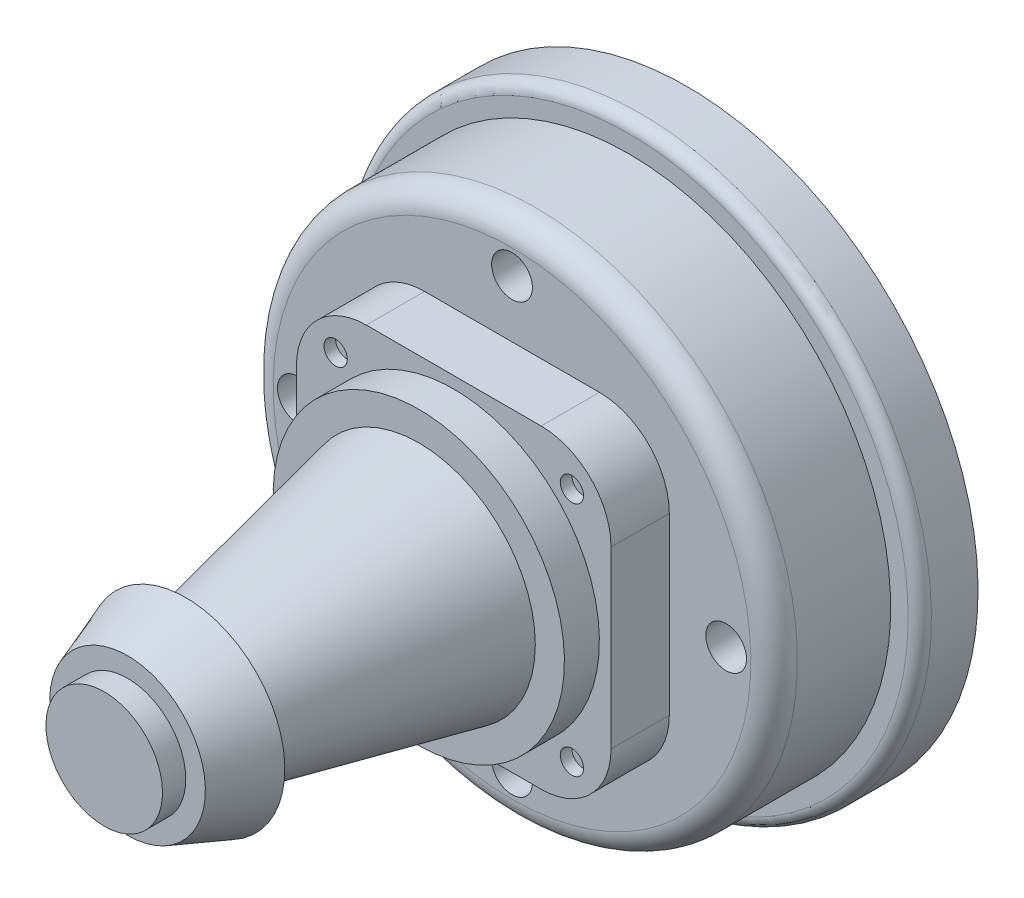
ISO-10303-21;
HEADER;
FILE_DESCRIPTION(('STEP AP214'),'2;1');
FILE_NAME('part.step','',(''),(''),'','','');
FILE_SCHEMA(('AUTOMOTIVE_DESIGN { 1 0 10303 214 1 1 1 1 }'));
ENDSEC;
DATA;
#1=APPLICATION_CONTEXT('core data for automotive mechanical design processes');
#2=APPLICATION_PROTOCOL_DEFINITION('international standard','automotive_design',2000,#1);
#3=PRODUCT_CONTEXT('',#1,'mechanical');
#4=PRODUCT('Part','Part','',(#3));
#5=PRODUCT_RELATED_PRODUCT_CATEGORY('part','',(#4));
#6=PRODUCT_DEFINITION_FORMATION('','',#4);
#7=PRODUCT_DEFINITION_CONTEXT('part definition',#1,'design');
#8=PRODUCT_DEFINITION('design','',#6,#7);
#9=PRODUCT_DEFINITION_SHAPE('','',#8);
#10=(LENGTH_UNIT() NAMED_UNIT(*) SI_UNIT(.MILLI.,.METRE.));
#11=(NAMED_UNIT(*) PLANE_ANGLE_UNIT() SI_UNIT($,.RADIAN.));
#12=(NAMED_UNIT(*) SI_UNIT($,.STERADIAN.) SOLID_ANGLE_UNIT());
#13=UNCERTAINTY_MEASURE_WITH_UNIT(LENGTH_MEASURE(1.E-05),#10,'distance_accuracy_value','');
#14=(GEOMETRIC_REPRESENTATION_CONTEXT(3) GLOBAL_UNCERTAINTY_ASSIGNED_CONTEXT((#13)) GLOBAL_UNIT_ASSIGNED_CONTEXT((#10,
#11,#12)) REPRESENTATION_CONTEXT('',''));
#15=CARTESIAN_POINT('',(0.,0.,0.));
#16=DIRECTION('',(0.,0.,1.));
#17=DIRECTION('',(1.,0.,0.));
#18=AXIS2_PLACEMENT_3D('',#15,#16,#17);
#19=CARTESIAN_POINT('',(0.,0.,10.));
#20=DIRECTION('',(0.,0.,1.));
#21=DIRECTION('',(0.,-1.,0.));
#22=AXIS2_PLACEMENT_3D('',#19,#20,#21);
#23=PLANE('',#22);
#24=CARTESIAN_POINT('',(0.,0.,10.));
#25=DIRECTION('',(0.,0.,1.));
#26=DIRECTION('',(0.,-1.,0.));
#27=AXIS2_PLACEMENT_3D('',#24,#25,#26);
#28=CIRCLE('',#27,20.5);
#29=CARTESIAN_POINT('',(0.,-20.5,9.99999999999993));
#30=VERTEX_POINT('',#29);
#31=EDGE_CURVE('E171',#30,#30,#28,.T.);
#32=ORIENTED_EDGE('',*,*,#31,.T.);
#33=EDGE_LOOP('',(#32));
#34=FACE_BOUND('',#33,.T.);
#35=DIRECTION('',(0.,1.,0.));
#36=VECTOR('',#35,1.);
#37=CARTESIAN_POINT('',(13.5,13.5,10.));
#38=LINE('',#37,#36);
#39=CARTESIAN_POINT('',(13.5,-7.50000000000003,9.99999999999997));
#40=VERTEX_POINT('',#39);
#41=CARTESIAN_POINT('',(13.5,7.49999999999996,10.));
#42=VERTEX_POINT('',#41);
#43=EDGE_CURVE('E117',#40,#42,#38,.T.);
#44=ORIENTED_EDGE('',*,*,#43,.F.);
#45=CARTESIAN_POINT('',(7.5,-7.50000000000003,9.99999999999997));
#46=DIRECTION('',(0.,0.,1.));
#47=DIRECTION('',(0.,-1.,0.));
#48=AXIS2_PLACEMENT_3D('',#45,#46,#47);
#49=CIRCLE('',#48,6.);
#50=CARTESIAN_POINT('',(7.5,-13.5,9.99999999999995));
#51=VERTEX_POINT('',#50);
#52=EDGE_CURVE('E101',#40,#51,#49,.F.);
#53=ORIENTED_EDGE('',*,*,#52,.T.);
#54=DIRECTION('',(1.,0.,0.));
#55=VECTOR('',#54,1.);
#56=CARTESIAN_POINT('',(-13.5,-13.5,9.99999999999995));
#57=LINE('',#56,#55);
#58=CARTESIAN_POINT('',(-7.5,-13.5,9.99999999999995));
#59=VERTEX_POINT('',#58);
#60=EDGE_CURVE('E138',#59,#51,#57,.T.);
#61=ORIENTED_EDGE('',*,*,#60,.F.);
#62=CARTESIAN_POINT('',(-7.5,-7.50000000000004,9.99999999999997));
#63=DIRECTION('',(0.,0.,1.));
#64=DIRECTION('',(0.,-1.,0.));
#65=AXIS2_PLACEMENT_3D('',#62,#63,#64);
#66=CIRCLE('',#65,6.);
#67=CARTESIAN_POINT('',(-13.5,-7.50000000000004,9.99999999999997));
#68=VERTEX_POINT('',#67);
#69=EDGE_CURVE('E110',#59,#68,#66,.F.);
#70=ORIENTED_EDGE('',*,*,#69,.T.);
#71=DIRECTION('',(0.,-1.,0.));
#72=VECTOR('',#71,1.);
#73=CARTESIAN_POINT('',(-13.5,13.5,10.));
#74=LINE('',#73,#72);
#75=CARTESIAN_POINT('',(-13.5,7.49999999999996,10.));
#76=VERTEX_POINT('',#75);
#77=EDGE_CURVE('E127',#76,#68,#74,.T.);
#78=ORIENTED_EDGE('',*,*,#77,.F.);
#79=CARTESIAN_POINT('',(-7.5,7.49999999999996,10.));
#80=DIRECTION('',(0.,0.,1.));
#81=DIRECTION('',(0.,-1.,0.));
#82=AXIS2_PLACEMENT_3D('',#79,#80,#81);
#83=CIRCLE('',#82,6.);
#84=CARTESIAN_POINT('',(-7.5,13.5,10.));
#85=VERTEX_POINT('',#84);
#86=EDGE_CURVE('E49',#76,#85,#83,.F.);
#87=ORIENTED_EDGE('',*,*,#86,.T.);
#88=DIRECTION('',(-1.,0.,0.));
#89=VECTOR('',#88,1.);
#90=CARTESIAN_POINT('',(-13.5,13.5,10.));
#91=LINE('',#90,#89);
#92=CARTESIAN_POINT('',(7.5,13.5,10.));
#93=VERTEX_POINT('',#92);
#94=EDGE_CURVE('E124',#93,#85,#91,.T.);
#95=ORIENTED_EDGE('',*,*,#94,.F.);
#96=CARTESIAN_POINT('',(7.5,7.49999999999996,10.));
#97=DIRECTION('',(0.,0.,1.));
#98=DIRECTION('',(0.,-1.,0.));
#99=AXIS2_PLACEMENT_3D('',#96,#97,#98);
#100=CIRCLE('',#99,6.);
#101=EDGE_CURVE('E57',#93,#42,#100,.F.);
#102=ORIENTED_EDGE('',*,*,#101,.T.);
#103=EDGE_LOOP('',(#44,#53,#61,#70,#78,#87,#95,#102));
#104=FACE_BOUND('',#103,.T.);
#105=CARTESIAN_POINT('',(0.,18.4002200026304,10.0000000000001));
#106=DIRECTION('',(0.,0.,1.));
#107=DIRECTION('',(0.,-1.,0.));
#108=AXIS2_PLACEMENT_3D('',#105,#106,#107);
#109=CIRCLE('',#108,1.75);
#110=CARTESIAN_POINT('',(0.,16.6502200026304,10.0000000000001));
#111=VERTEX_POINT('',#110);
#112=EDGE_CURVE('E274',#111,#111,#109,.T.);
#113=ORIENTED_EDGE('',*,*,#112,.F.);
#114=EDGE_LOOP('',(#113));
#115=FACE_BOUND('',#114,.T.);
#116=CARTESIAN_POINT('',(-18.3793841853392,0.,10.));
#117=DIRECTION('',(0.,0.,1.));
#118=DIRECTION('',(0.,-1.,0.));
#119=AXIS2_PLACEMENT_3D('',#116,#117,#118);
#120=CIRCLE('',#119,1.75);
#121=CARTESIAN_POINT('',(-18.3793841853392,-1.75000000000003,9.99999999999999));
#122=VERTEX_POINT('',#121);
#123=EDGE_CURVE('E278',#122,#122,#120,.T.);
#124=ORIENTED_EDGE('',*,*,#123,.F.);
#125=EDGE_LOOP('',(#124));
#126=FACE_BOUND('',#125,.T.);
#127=CARTESIAN_POINT('',(0.,-18.4002200026304,9.99999999999993));
#128=DIRECTION('',(0.,0.,-1.));
#129=DIRECTION('',(0.,1.,0.));
#130=AXIS2_PLACEMENT_3D('',#127,#128,#129);
#131=CIRCLE('',#130,1.75);
#132=CARTESIAN_POINT('',(0.,-16.6502200026304,9.99999999999994));
#133=VERTEX_POINT('',#132);
#134=EDGE_CURVE('E295',#133,#133,#131,.T.);
#135=ORIENTED_EDGE('',*,*,#134,.T.);
#136=EDGE_LOOP('',(#135));
#137=FACE_BOUND('',#136,.T.);
#138=CARTESIAN_POINT('',(18.3793841853392,0.,10.));
#139=DIRECTION('',(0.,0.,-1.));
#140=DIRECTION('',(0.,-1.,0.));
#141=AXIS2_PLACEMENT_3D('',#138,#139,#140);
#142=CIRCLE('',#141,1.75);
#143=CARTESIAN_POINT('',(18.3793841853392,-1.75000000000003,9.99999999999999));
#144=VERTEX_POINT('',#143);
#145=EDGE_CURVE('E313',#144,#144,#142,.T.);
#146=ORIENTED_EDGE('',*,*,#145,.T.);
#147=EDGE_LOOP('',(#146));
#148=FACE_BOUND('',#147,.T.);
#149=ADVANCED_FACE('F34',(#34,#104,#115,#126,#137,#148),#23,.T.);
#150=CARTESIAN_POINT('',(0.,0.,0.));
#151=DIRECTION('',(0.,0.,-1.));
#152=DIRECTION('',(0.,1.,0.));
#153=AXIS2_PLACEMENT_3D('',#150,#151,#152);
#154=CYLINDRICAL_SURFACE('',#153,25.);
#155=CARTESIAN_POINT('',(0.,0.,-1.));
#156=DIRECTION('',(0.,0.,1.));
#157=DIRECTION('',(0.,-1.,0.));
#158=AXIS2_PLACEMENT_3D('',#155,#156,#157);
#159=CIRCLE('',#158,25.);
#160=CARTESIAN_POINT('',(0.,-25.,-1.00000000000009));
#161=VERTEX_POINT('',#160);
#162=EDGE_CURVE('E11',#161,#161,#159,.F.);
#163=ORIENTED_EDGE('',*,*,#162,.T.);
#164=EDGE_LOOP('',(#163));
#165=FACE_BOUND('',#164,.T.);
#166=CARTESIAN_POINT('',(0.,0.,-5.));
#167=DIRECTION('',(0.,0.,1.));
#168=DIRECTION('',(0.,-1.,0.));
#169=AXIS2_PLACEMENT_3D('',#166,#167,#168);
#170=CIRCLE('',#169,25.);
#171=CARTESIAN_POINT('',(0.,-25.,-5.00000000000009));
#172=VERTEX_POINT('',#171);
#173=EDGE_CURVE('E144',#172,#172,#170,.T.);
#174=ORIENTED_EDGE('',*,*,#173,.T.);
#175=EDGE_LOOP('',(#174));
#176=FACE_BOUND('',#175,.T.);
#177=ADVANCED_FACE('F192',(#165,#176),#154,.T.);
#178=CARTESIAN_POINT('',(0.,0.,0.));
#179=DIRECTION('',(0.,0.,1.));
#180=DIRECTION('',(0.,-1.,0.));
#181=AXIS2_PLACEMENT_3D('',#178,#179,#180);
#182=PLANE('',#181);
#183=CARTESIAN_POINT('',(0.,0.,0.));
#184=DIRECTION('',(0.,0.,1.));
#185=DIRECTION('',(0.,-1.,0.));
#186=AXIS2_PLACEMENT_3D('',#183,#184,#185);
#187=CIRCLE('',#186,24.);
#188=CARTESIAN_POINT('',(0.,-24.,0.));
#189=VERTEX_POINT('',#188);
#190=EDGE_CURVE('E42',#189,#189,#187,.T.);
#191=ORIENTED_EDGE('',*,*,#190,.T.);
#192=EDGE_LOOP('',(#191));
#193=FACE_BOUND('',#192,.T.);
#194=CARTESIAN_POINT('',(0.,0.,0.));
#195=DIRECTION('',(0.,0.,1.));
#196=DIRECTION('',(0.,-1.,0.));
#197=AXIS2_PLACEMENT_3D('',#194,#195,#196);
#198=CIRCLE('',#197,22.5);
#199=CARTESIAN_POINT('',(0.,-22.5,0.));
#200=VERTEX_POINT('',#199);
#201=EDGE_CURVE('E140',#200,#200,#198,.T.);
#202=ORIENTED_EDGE('',*,*,#201,.F.);
#203=EDGE_LOOP('',(#202));
#204=FACE_BOUND('',#203,.T.);
#205=ADVANCED_FACE('F179',(#193,#204),#182,.T.);
#206=CARTESIAN_POINT('',(0.,0.,-5.));
#207=DIRECTION('',(0.,0.,1.));
#208=DIRECTION('',(0.,-1.,0.));
#209=AXIS2_PLACEMENT_3D('',#206,#207,#208);
#210=PLANE('',#209);
#211=CARTESIAN_POINT('',(0.,0.,-5.));
#212=DIRECTION('',(0.,0.,-1.));
#213=DIRECTION('',(0.,1.,0.));
#214=AXIS2_PLACEMENT_3D('',#211,#212,#213);
#215=CIRCLE('',#214,10.);
#216=CARTESIAN_POINT('',(0.,10.,-4.99999999999997));
#217=VERTEX_POINT('',#216);
#218=EDGE_CURVE('E319',#217,#217,#215,.T.);
#219=ORIENTED_EDGE('',*,*,#218,.F.);
#220=EDGE_LOOP('',(#219));
#221=FACE_BOUND('',#220,.T.);
#222=ORIENTED_EDGE('',*,*,#173,.F.);
#223=EDGE_LOOP('',(#222));
#224=FACE_BOUND('',#223,.T.);
#225=ADVANCED_FACE('F206',(#221,#224),#210,.F.);
#226=CARTESIAN_POINT('',(0.,0.,10.));
#227=DIRECTION('',(0.,0.,-1.));
#228=DIRECTION('',(0.,1.,0.));
#229=AXIS2_PLACEMENT_3D('',#226,#227,#228);
#230=CYLINDRICAL_SURFACE('',#229,22.5);
#231=CARTESIAN_POINT('',(0.,0.,8.));
#232=DIRECTION('',(0.,0.,1.));
#233=DIRECTION('',(0.,-1.,0.));
#234=AXIS2_PLACEMENT_3D('',#231,#232,#233);
#235=CIRCLE('',#234,22.5);
#236=CARTESIAN_POINT('',(0.,-22.5,7.99999999999992));
#237=VERTEX_POINT('',#236);
#238=EDGE_CURVE('E174',#237,#237,#235,.F.);
#239=ORIENTED_EDGE('',*,*,#238,.T.);
#240=EDGE_LOOP('',(#239));
#241=FACE_BOUND('',#240,.T.);
#242=ORIENTED_EDGE('',*,*,#201,.T.);
#243=EDGE_LOOP('',(#242));
#244=FACE_BOUND('',#243,.T.);
#245=ADVANCED_FACE('F203',(#241,#244),#230,.T.);
#246=CARTESIAN_POINT('',(13.5,13.4999999999999,15.));
#247=DIRECTION('',(-1.,0.,0.));
#248=DIRECTION('',(0.,-1.,0.));
#249=AXIS2_PLACEMENT_3D('',#246,#247,#248);
#250=PLANE('',#249);
#251=DIRECTION('',(0.,1.,0.));
#252=VECTOR('',#251,1.);
#253=CARTESIAN_POINT('',(13.5,13.4999999999999,15.));
#254=LINE('',#253,#252);
#255=CARTESIAN_POINT('',(13.5,-7.50000000000005,15.));
#256=VERTEX_POINT('',#255);
#257=CARTESIAN_POINT('',(13.5,7.49999999999995,15.));
#258=VERTEX_POINT('',#257);
#259=EDGE_CURVE('E119',#256,#258,#254,.T.);
#260=ORIENTED_EDGE('',*,*,#259,.F.);
#261=DIRECTION('',(0.,0.,-1.));
#262=VECTOR('',#261,1.);
#263=CARTESIAN_POINT('',(13.5,-7.50000000000005,15.));
#264=LINE('',#263,#262);
#265=EDGE_CURVE('E105',#256,#40,#264,.T.);
#266=ORIENTED_EDGE('',*,*,#265,.T.);
#267=ORIENTED_EDGE('',*,*,#43,.T.);
#268=DIRECTION('',(0.,0.,-1.));
#269=VECTOR('',#268,1.);
#270=CARTESIAN_POINT('',(13.5,7.49999999999995,15.));
#271=LINE('',#270,#269);
#272=EDGE_CURVE('E121',#42,#258,#271,.F.);
#273=ORIENTED_EDGE('',*,*,#272,.T.);
#274=EDGE_LOOP('',(#260,#266,#267,#273));
#275=FACE_BOUND('',#274,.T.);
#276=ADVANCED_FACE('F116',(#275),#250,.F.);
#277=CARTESIAN_POINT('',(-13.5,13.4999999999999,15.));
#278=DIRECTION('',(0.,-1.,0.));
#279=DIRECTION('',(1.,0.,0.));
#280=AXIS2_PLACEMENT_3D('',#277,#278,#279);
#281=PLANE('',#280);
#282=DIRECTION('',(-1.,0.,0.));
#283=VECTOR('',#282,1.);
#284=CARTESIAN_POINT('',(-13.5,13.4999999999999,15.));
#285=LINE('',#284,#283);
#286=CARTESIAN_POINT('',(7.5,13.4999999999999,15.));
#287=VERTEX_POINT('',#286);
#288=CARTESIAN_POINT('',(-7.5,13.4999999999999,15.));
#289=VERTEX_POINT('',#288);
#290=EDGE_CURVE('E245',#287,#289,#285,.T.);
#291=ORIENTED_EDGE('',*,*,#290,.F.);
#292=DIRECTION('',(0.,0.,-1.));
#293=VECTOR('',#292,1.);
#294=CARTESIAN_POINT('',(7.5,13.4999999999999,15.));
#295=LINE('',#294,#293);
#296=EDGE_CURVE('E111',#287,#93,#295,.T.);
#297=ORIENTED_EDGE('',*,*,#296,.T.);
#298=ORIENTED_EDGE('',*,*,#94,.T.);
#299=DIRECTION('',(0.,0.,-1.));
#300=VECTOR('',#299,1.);
#301=CARTESIAN_POINT('',(-7.5,13.4999999999999,15.));
#302=LINE('',#301,#300);
#303=EDGE_CURVE('E165',#85,#289,#302,.F.);
#304=ORIENTED_EDGE('',*,*,#303,.T.);
#305=EDGE_LOOP('',(#291,#297,#298,#304));
#306=FACE_BOUND('',#305,.T.);
#307=ADVANCED_FACE('F437',(#306),#281,.F.);
#308=CARTESIAN_POINT('',(-13.5,13.4999999999999,15.));
#309=DIRECTION('',(1.,0.,0.));
#310=DIRECTION('',(0.,1.,0.));
#311=AXIS2_PLACEMENT_3D('',#308,#309,#310);
#312=PLANE('',#311);
#313=ORIENTED_EDGE('',*,*,#77,.T.);
#314=DIRECTION('',(0.,0.,-1.));
#315=VECTOR('',#314,1.);
#316=CARTESIAN_POINT('',(-13.5,-7.50000000000006,15.));
#317=LINE('',#316,#315);
#318=CARTESIAN_POINT('',(-13.5,-7.50000000000006,15.));
#319=VERTEX_POINT('',#318);
#320=EDGE_CURVE('E163',#68,#319,#317,.F.);
#321=ORIENTED_EDGE('',*,*,#320,.T.);
#322=DIRECTION('',(0.,-1.,0.));
#323=VECTOR('',#322,1.);
#324=CARTESIAN_POINT('',(-13.5,13.4999999999999,15.));
#325=LINE('',#324,#323);
#326=CARTESIAN_POINT('',(-13.5,7.49999999999994,15.));
#327=VERTEX_POINT('',#326);
#328=EDGE_CURVE('E242',#327,#319,#325,.T.);
#329=ORIENTED_EDGE('',*,*,#328,.F.);
#330=DIRECTION('',(0.,0.,-1.));
#331=VECTOR('',#330,1.);
#332=CARTESIAN_POINT('',(-13.5,7.49999999999994,15.));
#333=LINE('',#332,#331);
#334=EDGE_CURVE('E160',#327,#76,#333,.T.);
#335=ORIENTED_EDGE('',*,*,#334,.T.);
#336=EDGE_LOOP('',(#313,#321,#329,#335));
#337=FACE_BOUND('',#336,.T.);
#338=ADVANCED_FACE('F247',(#337),#312,.F.);
#339=CARTESIAN_POINT('',(-13.5,-13.5000000000001,15.));
#340=DIRECTION('',(0.,1.,0.));
#341=DIRECTION('',(-1.,0.,0.));
#342=AXIS2_PLACEMENT_3D('',#339,#340,#341);
#343=PLANE('',#342);
#344=ORIENTED_EDGE('',*,*,#60,.T.);
#345=DIRECTION('',(0.,0.,-1.));
#346=VECTOR('',#345,1.);
#347=CARTESIAN_POINT('',(7.5,-13.5000000000001,15.));
#348=LINE('',#347,#346);
#349=CARTESIAN_POINT('',(7.5,-13.5000000000001,15.));
#350=VERTEX_POINT('',#349);
#351=EDGE_CURVE('E106',#51,#350,#348,.F.);
#352=ORIENTED_EDGE('',*,*,#351,.T.);
#353=DIRECTION('',(1.,0.,0.));
#354=VECTOR('',#353,1.);
#355=CARTESIAN_POINT('',(-13.5,-13.5000000000001,15.));
#356=LINE('',#355,#354);
#357=CARTESIAN_POINT('',(-7.5,-13.5000000000001,15.));
#358=VERTEX_POINT('',#357);
#359=EDGE_CURVE('E133',#358,#350,#356,.T.);
#360=ORIENTED_EDGE('',*,*,#359,.F.);
#361=DIRECTION('',(0.,0.,-1.));
#362=VECTOR('',#361,1.);
#363=CARTESIAN_POINT('',(-7.5,-13.5000000000001,15.));
#364=LINE('',#363,#362);
#365=EDGE_CURVE('E120',#358,#59,#364,.T.);
#366=ORIENTED_EDGE('',*,*,#365,.T.);
#367=EDGE_LOOP('',(#344,#352,#360,#366));
#368=FACE_BOUND('',#367,.T.);
#369=ADVANCED_FACE('F431',(#368),#343,.F.);
#370=CARTESIAN_POINT('',(0.,0.,15.));
#371=DIRECTION('',(0.,0.,1.));
#372=DIRECTION('',(0.,-1.,0.));
#373=AXIS2_PLACEMENT_3D('',#370,#371,#372);
#374=PLANE('',#373);
#375=CARTESIAN_POINT('',(-10.1392516649657,-10.1392516649656,15.));
#376=DIRECTION('',(0.,0.,-1.));
#377=DIRECTION('',(0.,1.,0.));
#378=AXIS2_PLACEMENT_3D('',#375,#376,#377);
#379=CIRCLE('',#378,0.999999999999999);
#380=CARTESIAN_POINT('',(-10.1392516649657,-9.13925166496562,15.));
#381=VERTEX_POINT('',#380);
#382=EDGE_CURVE('E308',#381,#381,#379,.T.);
#383=ORIENTED_EDGE('',*,*,#382,.T.);
#384=EDGE_LOOP('',(#383));
#385=FACE_BOUND('',#384,.T.);
#386=CARTESIAN_POINT('',(10.1392516649655,-10.1392516649656,15.));
#387=DIRECTION('',(0.,0.,-1.));
#388=DIRECTION('',(0.,1.,0.));
#389=AXIS2_PLACEMENT_3D('',#386,#387,#388);
#390=CIRCLE('',#389,0.999999999999999);
#391=CARTESIAN_POINT('',(10.1392516649655,-9.13925166496562,15.));
#392=VERTEX_POINT('',#391);
#393=EDGE_CURVE('E301',#392,#392,#390,.T.);
#394=ORIENTED_EDGE('',*,*,#393,.T.);
#395=EDGE_LOOP('',(#394));
#396=FACE_BOUND('',#395,.T.);
#397=CARTESIAN_POINT('',(-10.1392516649657,10.1392516649655,15.));
#398=DIRECTION('',(0.,0.,1.));
#399=DIRECTION('',(0.,-1.,0.));
#400=AXIS2_PLACEMENT_3D('',#397,#398,#399);
#401=CIRCLE('',#400,0.999999999999999);
#402=CARTESIAN_POINT('',(-10.1392516649657,9.13925166496551,15.));
#403=VERTEX_POINT('',#402);
#404=EDGE_CURVE('E290',#403,#403,#401,.T.);
#405=ORIENTED_EDGE('',*,*,#404,.F.);
#406=EDGE_LOOP('',(#405));
#407=FACE_BOUND('',#406,.T.);
#408=CARTESIAN_POINT('',(10.1392516649655,10.1392516649655,15.));
#409=DIRECTION('',(0.,0.,1.));
#410=DIRECTION('',(0.,-1.,0.));
#411=AXIS2_PLACEMENT_3D('',#408,#409,#410);
#412=CIRCLE('',#411,0.999999999999999);
#413=CARTESIAN_POINT('',(10.1392516649655,9.13925166496551,15.));
#414=VERTEX_POINT('',#413);
#415=EDGE_CURVE('E286',#414,#414,#412,.T.);
#416=ORIENTED_EDGE('',*,*,#415,.F.);
#417=EDGE_LOOP('',(#416));
#418=FACE_BOUND('',#417,.T.);
#419=CARTESIAN_POINT('',(0.,0.,15.));
#420=DIRECTION('',(0.,0.,1.));
#421=DIRECTION('',(0.,-1.,0.));
#422=AXIS2_PLACEMENT_3D('',#419,#420,#421);
#423=CIRCLE('',#422,12.5);
#424=CARTESIAN_POINT('',(0.,-12.5000000000001,15.));
#425=VERTEX_POINT('',#424);
#426=EDGE_CURVE('E143',#425,#425,#423,.T.);
#427=ORIENTED_EDGE('',*,*,#426,.F.);
#428=EDGE_LOOP('',(#427));
#429=FACE_BOUND('',#428,.T.);
#430=ORIENTED_EDGE('',*,*,#359,.T.);
#431=CARTESIAN_POINT('',(7.5,-7.50000000000005,15.));
#432=DIRECTION('',(0.,0.,1.));
#433=DIRECTION('',(0.,-1.,0.));
#434=AXIS2_PLACEMENT_3D('',#431,#432,#433);
#435=CIRCLE('',#434,6.);
#436=EDGE_CURVE('E158',#350,#256,#435,.T.);
#437=ORIENTED_EDGE('',*,*,#436,.T.);
#438=ORIENTED_EDGE('',*,*,#259,.T.);
#439=CARTESIAN_POINT('',(7.5,7.49999999999995,15.));
#440=DIRECTION('',(0.,0.,1.));
#441=DIRECTION('',(0.,-1.,0.));
#442=AXIS2_PLACEMENT_3D('',#439,#440,#441);
#443=CIRCLE('',#442,6.);
#444=EDGE_CURVE('E154',#258,#287,#443,.T.);
#445=ORIENTED_EDGE('',*,*,#444,.T.);
#446=ORIENTED_EDGE('',*,*,#290,.T.);
#447=CARTESIAN_POINT('',(-7.5,7.49999999999995,15.));
#448=DIRECTION('',(0.,0.,1.));
#449=DIRECTION('',(0.,-1.,0.));
#450=AXIS2_PLACEMENT_3D('',#447,#448,#449);
#451=CIRCLE('',#450,6.);
#452=EDGE_CURVE('E152',#289,#327,#451,.T.);
#453=ORIENTED_EDGE('',*,*,#452,.T.);
#454=ORIENTED_EDGE('',*,*,#328,.T.);
#455=CARTESIAN_POINT('',(-7.5,-7.50000000000005,15.));
#456=DIRECTION('',(0.,0.,1.));
#457=DIRECTION('',(0.,-1.,0.));
#458=AXIS2_PLACEMENT_3D('',#455,#456,#457);
#459=CIRCLE('',#458,6.);
#460=EDGE_CURVE('E156',#319,#358,#459,.T.);
#461=ORIENTED_EDGE('',*,*,#460,.T.);
#462=EDGE_LOOP('',(#430,#437,#438,#445,#446,#453,#454,#461));
#463=FACE_BOUND('',#462,.T.);
#464=ADVANCED_FACE('F241',(#385,#396,#407,#418,#429,#463),#374,.T.);
#465=CARTESIAN_POINT('',(0.,0.,18.));
#466=DIRECTION('',(0.,0.,-1.));
#467=DIRECTION('',(0.,1.,0.));
#468=AXIS2_PLACEMENT_3D('',#465,#466,#467);
#469=CYLINDRICAL_SURFACE('',#468,12.5);
#470=CARTESIAN_POINT('',(0.,0.,18.));
#471=DIRECTION('',(0.,0.,1.));
#472=DIRECTION('',(0.,-1.,0.));
#473=AXIS2_PLACEMENT_3D('',#470,#471,#472);
#474=CIRCLE('',#473,12.5);
#475=CARTESIAN_POINT('',(0.,-12.5000000000001,18.));
#476=VERTEX_POINT('',#475);
#477=EDGE_CURVE('E125',#476,#476,#474,.T.);
#478=ORIENTED_EDGE('',*,*,#477,.F.);
#479=EDGE_LOOP('',(#478));
#480=FACE_BOUND('',#479,.T.);
#481=ORIENTED_EDGE('',*,*,#426,.T.);
#482=EDGE_LOOP('',(#481));
#483=FACE_BOUND('',#482,.T.);
#484=ADVANCED_FACE('F424',(#480,#483),#469,.T.);
#485=CARTESIAN_POINT('',(0.,0.,18.));
#486=DIRECTION('',(0.,0.,1.));
#487=DIRECTION('',(0.,-1.,0.));
#488=AXIS2_PLACEMENT_3D('',#485,#486,#487);
#489=PLANE('',#488);
#490=CARTESIAN_POINT('',(0.,0.,18.));
#491=DIRECTION('',(0.,0.,1.));
#492=DIRECTION('',(0.,-1.,0.));
#493=AXIS2_PLACEMENT_3D('',#490,#491,#492);
#494=CIRCLE('',#493,10.);
#495=CARTESIAN_POINT('',(0.,-10.0000000000001,18.));
#496=VERTEX_POINT('',#495);
#497=EDGE_CURVE('E253',#496,#496,#494,.T.);
#498=ORIENTED_EDGE('',*,*,#497,.F.);
#499=EDGE_LOOP('',(#498));
#500=FACE_BOUND('',#499,.T.);
#501=ORIENTED_EDGE('',*,*,#477,.T.);
#502=EDGE_LOOP('',(#501));
#503=FACE_BOUND('',#502,.T.);
#504=ADVANCED_FACE('F420',(#500,#503),#489,.T.);
#505=CARTESIAN_POINT('',(0.,0.,18.));
#506=DIRECTION('',(0.,0.,-1.));
#507=DIRECTION('',(0.,-1.,0.));
#508=AXIS2_PLACEMENT_3D('',#505,#506,#507);
#509=CONICAL_SURFACE('',#508,10.,0.20943951023932);
#510=CARTESIAN_POINT('',(0.,-1.32676290876039E-13,38.));
#511=DIRECTION('',(0.,0.,1.));
#512=DIRECTION('',(0.,-1.,0.));
#513=AXIS2_PLACEMENT_3D('',#510,#511,#512);
#514=CIRCLE('',#513,5.74886876659956);
#515=CARTESIAN_POINT('',(0.,-5.74886876659969,38.));
#516=VERTEX_POINT('',#515);
#517=EDGE_CURVE('E130',#516,#516,#514,.T.);
#518=ORIENTED_EDGE('',*,*,#517,.F.);
#519=EDGE_LOOP('',(#518));
#520=FACE_BOUND('',#519,.T.);
#521=ORIENTED_EDGE('',*,*,#497,.T.);
#522=EDGE_LOOP('',(#521));
#523=FACE_BOUND('',#522,.T.);
#524=ADVANCED_FACE('F416',(#520,#523),#509,.T.);
#525=CARTESIAN_POINT('',(0.,-1.32676290876039E-13,38.));
#526=DIRECTION('',(0.,0.,-1.));
#527=DIRECTION('',(0.,-1.,0.));
#528=AXIS2_PLACEMENT_3D('',#525,#526,#527);
#529=CONICAL_SURFACE('',#528,8.5,0.349065850398866);
#530=CARTESIAN_POINT('',(0.,-1.50133697570255E-13,43.));
#531=DIRECTION('',(0.,0.,1.));
#532=DIRECTION('',(0.,-1.,0.));
#533=AXIS2_PLACEMENT_3D('',#530,#531,#532);
#534=CIRCLE('',#533,6.68014882866899);
#535=CARTESIAN_POINT('',(0.,-6.68014882866914,43.));
#536=VERTEX_POINT('',#535);
#537=EDGE_CURVE('E257',#536,#536,#534,.T.);
#538=ORIENTED_EDGE('',*,*,#537,.F.);
#539=EDGE_LOOP('',(#538));
#540=FACE_BOUND('',#539,.T.);
#541=CARTESIAN_POINT('',(0.,-1.32676290876039E-13,38.));
#542=DIRECTION('',(0.,0.,1.));
#543=DIRECTION('',(0.,-1.,0.));
#544=AXIS2_PLACEMENT_3D('',#541,#542,#543);
#545=CIRCLE('',#544,8.5);
#546=CARTESIAN_POINT('',(0.,-8.50000000000013,38.));
#547=VERTEX_POINT('',#546);
#548=EDGE_CURVE('E262',#547,#547,#545,.T.);
#549=ORIENTED_EDGE('',*,*,#548,.T.);
#550=EDGE_LOOP('',(#549));
#551=FACE_BOUND('',#550,.T.);
#552=ADVANCED_FACE('F409',(#540,#551),#529,.T.);
#553=CARTESIAN_POINT('',(0.,-1.50133697570255E-13,43.));
#554=DIRECTION('',(0.,0.,1.));
#555=DIRECTION('',(0.,-1.,0.));
#556=AXIS2_PLACEMENT_3D('',#553,#554,#555);
#557=PLANE('',#556);
#558=CARTESIAN_POINT('',(0.,-1.50133697570255E-13,43.));
#559=DIRECTION('',(0.,0.,1.));
#560=DIRECTION('',(0.,-1.,0.));
#561=AXIS2_PLACEMENT_3D('',#558,#559,#560);
#562=CIRCLE('',#561,5.);
#563=CARTESIAN_POINT('',(0.,-5.00000000000015,43.));
#564=VERTEX_POINT('',#563);
#565=EDGE_CURVE('E147',#564,#564,#562,.T.);
#566=ORIENTED_EDGE('',*,*,#565,.F.);
#567=EDGE_LOOP('',(#566));
#568=FACE_BOUND('',#567,.T.);
#569=ORIENTED_EDGE('',*,*,#537,.T.);
#570=EDGE_LOOP('',(#569));
#571=FACE_BOUND('',#570,.T.);
#572=ADVANCED_FACE('F406',(#568,#571),#557,.T.);
#573=CARTESIAN_POINT('',(0.,-1.32676290876039E-13,38.));
#574=DIRECTION('',(0.,0.,1.));
#575=DIRECTION('',(0.,-1.,0.));
#576=AXIS2_PLACEMENT_3D('',#573,#574,#575);
#577=PLANE('',#576);
#578=ORIENTED_EDGE('',*,*,#517,.T.);
#579=EDGE_LOOP('',(#578));
#580=FACE_BOUND('',#579,.T.);
#581=ORIENTED_EDGE('',*,*,#548,.F.);
#582=EDGE_LOOP('',(#581));
#583=FACE_BOUND('',#582,.T.);
#584=ADVANCED_FACE('F404',(#580,#583),#577,.F.);
#585=CARTESIAN_POINT('',(0.,-1.57116660247941E-13,45.));
#586=DIRECTION('',(0.,0.,-1.));
#587=DIRECTION('',(0.,1.,0.));
#588=AXIS2_PLACEMENT_3D('',#585,#586,#587);
#589=CYLINDRICAL_SURFACE('',#588,5.);
#590=CARTESIAN_POINT('',(0.,-1.57116660247941E-13,45.));
#591=DIRECTION('',(0.,0.,1.));
#592=DIRECTION('',(0.,-1.,0.));
#593=AXIS2_PLACEMENT_3D('',#590,#591,#592);
#594=CIRCLE('',#593,5.);
#595=CARTESIAN_POINT('',(0.,-5.00000000000016,45.));
#596=VERTEX_POINT('',#595);
#597=EDGE_CURVE('E265',#596,#596,#594,.T.);
#598=ORIENTED_EDGE('',*,*,#597,.F.);
#599=EDGE_LOOP('',(#598));
#600=FACE_BOUND('',#599,.T.);
#601=ORIENTED_EDGE('',*,*,#565,.T.);
#602=EDGE_LOOP('',(#601));
#603=FACE_BOUND('',#602,.T.);
#604=ADVANCED_FACE('F400',(#600,#603),#589,.T.);
#605=CARTESIAN_POINT('',(0.,-1.57116660247941E-13,45.));
#606=DIRECTION('',(0.,0.,1.));
#607=DIRECTION('',(0.,-1.,0.));
#608=AXIS2_PLACEMENT_3D('',#605,#606,#607);
#609=PLANE('',#608);
#610=ORIENTED_EDGE('',*,*,#597,.T.);
#611=EDGE_LOOP('',(#610));
#612=FACE_BOUND('',#611,.T.);
#613=ADVANCED_FACE('F216',(#612),#609,.T.);
#614=CARTESIAN_POINT('',(7.5,-7.50000000000005,15.));
#615=DIRECTION('',(0.,0.,-1.));
#616=DIRECTION('',(0.,1.,0.));
#617=AXIS2_PLACEMENT_3D('',#614,#615,#616);
#618=CYLINDRICAL_SURFACE('',#617,6.);
#619=ORIENTED_EDGE('',*,*,#436,.F.);
#620=ORIENTED_EDGE('',*,*,#351,.F.);
#621=ORIENTED_EDGE('',*,*,#52,.F.);
#622=ORIENTED_EDGE('',*,*,#265,.F.);
#623=EDGE_LOOP('',(#619,#620,#621,#622));
#624=FACE_BOUND('',#623,.T.);
#625=ADVANCED_FACE('F104',(#624),#618,.T.);
#626=CARTESIAN_POINT('',(-7.5,-7.50000000000005,15.));
#627=DIRECTION('',(0.,0.,-1.));
#628=DIRECTION('',(0.,1.,0.));
#629=AXIS2_PLACEMENT_3D('',#626,#627,#628);
#630=CYLINDRICAL_SURFACE('',#629,6.);
#631=ORIENTED_EDGE('',*,*,#460,.F.);
#632=ORIENTED_EDGE('',*,*,#320,.F.);
#633=ORIENTED_EDGE('',*,*,#69,.F.);
#634=ORIENTED_EDGE('',*,*,#365,.F.);
#635=EDGE_LOOP('',(#631,#632,#633,#634));
#636=FACE_BOUND('',#635,.T.);
#637=ADVANCED_FACE('F215',(#636),#630,.T.);
#638=CARTESIAN_POINT('',(7.5,7.49999999999995,15.));
#639=DIRECTION('',(0.,0.,-1.));
#640=DIRECTION('',(0.,1.,0.));
#641=AXIS2_PLACEMENT_3D('',#638,#639,#640);
#642=CYLINDRICAL_SURFACE('',#641,6.);
#643=ORIENTED_EDGE('',*,*,#444,.F.);
#644=ORIENTED_EDGE('',*,*,#272,.F.);
#645=ORIENTED_EDGE('',*,*,#101,.F.);
#646=ORIENTED_EDGE('',*,*,#296,.F.);
#647=EDGE_LOOP('',(#643,#644,#645,#646));
#648=FACE_BOUND('',#647,.T.);
#649=ADVANCED_FACE('F219',(#648),#642,.T.);
#650=CARTESIAN_POINT('',(-7.5,7.49999999999995,15.));
#651=DIRECTION('',(0.,0.,-1.));
#652=DIRECTION('',(0.,1.,0.));
#653=AXIS2_PLACEMENT_3D('',#650,#651,#652);
#654=CYLINDRICAL_SURFACE('',#653,6.);
#655=ORIENTED_EDGE('',*,*,#452,.F.);
#656=ORIENTED_EDGE('',*,*,#303,.F.);
#657=ORIENTED_EDGE('',*,*,#86,.F.);
#658=ORIENTED_EDGE('',*,*,#334,.F.);
#659=EDGE_LOOP('',(#655,#656,#657,#658));
#660=FACE_BOUND('',#659,.T.);
#661=ADVANCED_FACE('F223',(#660),#654,.T.);
#662=CARTESIAN_POINT('',(0.,18.4002200026304,5.00000000000006));
#663=DIRECTION('',(0.,0.,1.));
#664=DIRECTION('',(0.,-1.,0.));
#665=AXIS2_PLACEMENT_3D('',#662,#663,#664);
#666=CYLINDRICAL_SURFACE('',#665,1.75);
#667=CARTESIAN_POINT('',(0.,18.4002200026304,5.00000000000006));
#668=DIRECTION('',(0.,0.,1.));
#669=DIRECTION('',(0.,-1.,0.));
#670=AXIS2_PLACEMENT_3D('',#667,#668,#669);
#671=CIRCLE('',#670,1.75);
#672=CARTESIAN_POINT('',(0.,16.6502200026304,5.00000000000006));
#673=VERTEX_POINT('',#672);
#674=EDGE_CURVE('E271',#673,#673,#671,.T.);
#675=ORIENTED_EDGE('',*,*,#674,.F.);
#676=EDGE_LOOP('',(#675));
#677=FACE_BOUND('',#676,.T.);
#678=ORIENTED_EDGE('',*,*,#112,.T.);
#679=EDGE_LOOP('',(#678));
#680=FACE_BOUND('',#679,.T.);
#681=ADVANCED_FACE('F225',(#677,#680),#666,.F.);
#682=CARTESIAN_POINT('',(0.,18.4002200026304,5.00000000000006));
#683=DIRECTION('',(0.,0.,1.));
#684=DIRECTION('',(0.,-1.,0.));
#685=AXIS2_PLACEMENT_3D('',#682,#683,#684);
#686=PLANE('',#685);
#687=ORIENTED_EDGE('',*,*,#674,.T.);
#688=EDGE_LOOP('',(#687));
#689=FACE_BOUND('',#688,.T.);
#690=ADVANCED_FACE('F230',(#689),#686,.T.);
#691=CARTESIAN_POINT('',(-18.3793841853392,0.,5.));
#692=DIRECTION('',(0.,0.,1.));
#693=DIRECTION('',(0.,-1.,0.));
#694=AXIS2_PLACEMENT_3D('',#691,#692,#693);
#695=CYLINDRICAL_SURFACE('',#694,1.75);
#696=CARTESIAN_POINT('',(-18.3793841853392,0.,5.));
#697=DIRECTION('',(0.,0.,1.));
#698=DIRECTION('',(0.,-1.,0.));
#699=AXIS2_PLACEMENT_3D('',#696,#697,#698);
#700=CIRCLE('',#699,1.75);
#701=CARTESIAN_POINT('',(-18.3793841853392,-1.75000000000002,4.99999999999999));
#702=VERTEX_POINT('',#701);
#703=EDGE_CURVE('E270',#702,#702,#700,.T.);
#704=ORIENTED_EDGE('',*,*,#703,.F.);
#705=EDGE_LOOP('',(#704));
#706=FACE_BOUND('',#705,.T.);
#707=ORIENTED_EDGE('',*,*,#123,.T.);
#708=EDGE_LOOP('',(#707));
#709=FACE_BOUND('',#708,.T.);
#710=ADVANCED_FACE('F390',(#706,#709),#695,.F.);
#711=CARTESIAN_POINT('',(-18.3793841853392,0.,5.));
#712=DIRECTION('',(0.,0.,1.));
#713=DIRECTION('',(0.,-1.,0.));
#714=AXIS2_PLACEMENT_3D('',#711,#712,#713);
#715=PLANE('',#714);
#716=ORIENTED_EDGE('',*,*,#703,.T.);
#717=EDGE_LOOP('',(#716));
#718=FACE_BOUND('',#717,.T.);
#719=ADVANCED_FACE('F383',(#718),#715,.T.);
#720=CARTESIAN_POINT('',(10.1392516649655,10.1392516649655,14.));
#721=DIRECTION('',(0.,0.,1.));
#722=DIRECTION('',(0.,-1.,0.));
#723=AXIS2_PLACEMENT_3D('',#720,#721,#722);
#724=CYLINDRICAL_SURFACE('',#723,0.999999999999999);
#725=CARTESIAN_POINT('',(10.1392516649655,10.1392516649655,14.));
#726=DIRECTION('',(0.,0.,1.));
#727=DIRECTION('',(0.,-1.,0.));
#728=AXIS2_PLACEMENT_3D('',#725,#726,#727);
#729=CIRCLE('',#728,0.999999999999999);
#730=CARTESIAN_POINT('',(10.1392516649655,9.13925166496552,14.));
#731=VERTEX_POINT('',#730);
#732=EDGE_CURVE('E283',#731,#731,#729,.T.);
#733=ORIENTED_EDGE('',*,*,#732,.F.);
#734=EDGE_LOOP('',(#733));
#735=FACE_BOUND('',#734,.T.);
#736=ORIENTED_EDGE('',*,*,#415,.T.);
#737=EDGE_LOOP('',(#736));
#738=FACE_BOUND('',#737,.T.);
#739=ADVANCED_FACE('F380',(#735,#738),#724,.F.);
#740=CARTESIAN_POINT('',(10.1392516649655,10.1392516649655,14.));
#741=DIRECTION('',(0.,0.,1.));
#742=DIRECTION('',(0.,-1.,0.));
#743=AXIS2_PLACEMENT_3D('',#740,#741,#742);
#744=PLANE('',#743);
#745=ORIENTED_EDGE('',*,*,#732,.T.);
#746=EDGE_LOOP('',(#745));
#747=FACE_BOUND('',#746,.T.);
#748=ADVANCED_FACE('F378',(#747),#744,.T.);
#749=CARTESIAN_POINT('',(-10.1392516649657,10.1392516649655,14.));
#750=DIRECTION('',(0.,0.,1.));
#751=DIRECTION('',(0.,-1.,0.));
#752=AXIS2_PLACEMENT_3D('',#749,#750,#751);
#753=CYLINDRICAL_SURFACE('',#752,0.999999999999999);
#754=CARTESIAN_POINT('',(-10.1392516649657,10.1392516649655,14.));
#755=DIRECTION('',(0.,0.,1.));
#756=DIRECTION('',(0.,-1.,0.));
#757=AXIS2_PLACEMENT_3D('',#754,#755,#756);
#758=CIRCLE('',#757,0.999999999999999);
#759=CARTESIAN_POINT('',(-10.1392516649657,9.13925166496552,14.));
#760=VERTEX_POINT('',#759);
#761=EDGE_CURVE('E275',#760,#760,#758,.T.);
#762=ORIENTED_EDGE('',*,*,#761,.F.);
#763=EDGE_LOOP('',(#762));
#764=FACE_BOUND('',#763,.T.);
#765=ORIENTED_EDGE('',*,*,#404,.T.);
#766=EDGE_LOOP('',(#765));
#767=FACE_BOUND('',#766,.T.);
#768=ADVANCED_FACE('F374',(#764,#767),#753,.F.);
#769=CARTESIAN_POINT('',(-10.1392516649657,10.1392516649655,14.));
#770=DIRECTION('',(0.,0.,1.));
#771=DIRECTION('',(0.,-1.,0.));
#772=AXIS2_PLACEMENT_3D('',#769,#770,#771);
#773=PLANE('',#772);
#774=ORIENTED_EDGE('',*,*,#761,.T.);
#775=EDGE_LOOP('',(#774));
#776=FACE_BOUND('',#775,.T.);
#777=ADVANCED_FACE('F370',(#776),#773,.T.);
#778=CARTESIAN_POINT('',(0.,-18.4002200026304,4.99999999999993));
#779=DIRECTION('',(0.,0.,1.));
#780=DIRECTION('',(0.,-1.,0.));
#781=AXIS2_PLACEMENT_3D('',#778,#779,#780);
#782=CYLINDRICAL_SURFACE('',#781,1.75);
#783=CARTESIAN_POINT('',(0.,-18.4002200026304,4.99999999999993));
#784=DIRECTION('',(0.,0.,-1.));
#785=DIRECTION('',(0.,1.,0.));
#786=AXIS2_PLACEMENT_3D('',#783,#784,#785);
#787=CIRCLE('',#786,1.75);
#788=CARTESIAN_POINT('',(0.,-16.6502200026304,4.99999999999994));
#789=VERTEX_POINT('',#788);
#790=EDGE_CURVE('E287',#789,#789,#787,.T.);
#791=ORIENTED_EDGE('',*,*,#790,.T.);
#792=EDGE_LOOP('',(#791));
#793=FACE_BOUND('',#792,.T.);
#794=ORIENTED_EDGE('',*,*,#134,.F.);
#795=EDGE_LOOP('',(#794));
#796=FACE_BOUND('',#795,.T.);
#797=ADVANCED_FACE('F366',(#793,#796),#782,.F.);
#798=CARTESIAN_POINT('',(0.,-18.4002200026304,4.99999999999993));
#799=DIRECTION('',(0.,0.,1.));
#800=DIRECTION('',(0.,1.,0.));
#801=AXIS2_PLACEMENT_3D('',#798,#799,#800);
#802=PLANE('',#801);
#803=ORIENTED_EDGE('',*,*,#790,.F.);
#804=EDGE_LOOP('',(#803));
#805=FACE_BOUND('',#804,.T.);
#806=ADVANCED_FACE('F362',(#805),#802,.T.);
#807=CARTESIAN_POINT('',(10.1392516649655,-10.1392516649656,14.));
#808=DIRECTION('',(0.,0.,1.));
#809=DIRECTION('',(0.,-1.,0.));
#810=AXIS2_PLACEMENT_3D('',#807,#808,#809);
#811=CYLINDRICAL_SURFACE('',#810,0.999999999999999);
#812=CARTESIAN_POINT('',(10.1392516649655,-10.1392516649656,14.));
#813=DIRECTION('',(0.,0.,-1.));
#814=DIRECTION('',(0.,1.,0.));
#815=AXIS2_PLACEMENT_3D('',#812,#813,#814);
#816=CIRCLE('',#815,0.999999999999999);
#817=CARTESIAN_POINT('',(10.1392516649655,-9.13925166496561,14.));
#818=VERTEX_POINT('',#817);
#819=EDGE_CURVE('E304',#818,#818,#816,.T.);
#820=ORIENTED_EDGE('',*,*,#819,.T.);
#821=EDGE_LOOP('',(#820));
#822=FACE_BOUND('',#821,.T.);
#823=ORIENTED_EDGE('',*,*,#393,.F.);
#824=EDGE_LOOP('',(#823));
#825=FACE_BOUND('',#824,.T.);
#826=ADVANCED_FACE('F358',(#822,#825),#811,.F.);
#827=CARTESIAN_POINT('',(10.1392516649655,-10.1392516649656,14.));
#828=DIRECTION('',(0.,0.,1.));
#829=DIRECTION('',(0.,1.,0.));
#830=AXIS2_PLACEMENT_3D('',#827,#828,#829);
#831=PLANE('',#830);
#832=ORIENTED_EDGE('',*,*,#819,.F.);
#833=EDGE_LOOP('',(#832));
#834=FACE_BOUND('',#833,.T.);
#835=ADVANCED_FACE('F354',(#834),#831,.T.);
#836=CARTESIAN_POINT('',(-10.1392516649657,-10.1392516649656,14.));
#837=DIRECTION('',(0.,0.,1.));
#838=DIRECTION('',(0.,-1.,0.));
#839=AXIS2_PLACEMENT_3D('',#836,#837,#838);
#840=CYLINDRICAL_SURFACE('',#839,0.999999999999999);
#841=CARTESIAN_POINT('',(-10.1392516649657,-10.1392516649656,14.));
#842=DIRECTION('',(0.,0.,-1.));
#843=DIRECTION('',(0.,1.,0.));
#844=AXIS2_PLACEMENT_3D('',#841,#842,#843);
#845=CIRCLE('',#844,0.999999999999999);
#846=CARTESIAN_POINT('',(-10.1392516649657,-9.13925166496561,14.));
#847=VERTEX_POINT('',#846);
#848=EDGE_CURVE('E298',#847,#847,#845,.T.);
#849=ORIENTED_EDGE('',*,*,#848,.T.);
#850=EDGE_LOOP('',(#849));
#851=FACE_BOUND('',#850,.T.);
#852=ORIENTED_EDGE('',*,*,#382,.F.);
#853=EDGE_LOOP('',(#852));
#854=FACE_BOUND('',#853,.T.);
#855=ADVANCED_FACE('F350',(#851,#854),#840,.F.);
#856=CARTESIAN_POINT('',(-10.1392516649657,-10.1392516649656,14.));
#857=DIRECTION('',(0.,0.,1.));
#858=DIRECTION('',(0.,1.,0.));
#859=AXIS2_PLACEMENT_3D('',#856,#857,#858);
#860=PLANE('',#859);
#861=ORIENTED_EDGE('',*,*,#848,.F.);
#862=EDGE_LOOP('',(#861));
#863=FACE_BOUND('',#862,.T.);
#864=ADVANCED_FACE('F346',(#863),#860,.T.);
#865=CARTESIAN_POINT('',(18.3793841853392,0.,5.));
#866=DIRECTION('',(0.,0.,1.));
#867=DIRECTION('',(0.,-1.,0.));
#868=AXIS2_PLACEMENT_3D('',#865,#866,#867);
#869=CYLINDRICAL_SURFACE('',#868,1.75);
#870=CARTESIAN_POINT('',(18.3793841853392,0.,5.));
#871=DIRECTION('',(0.,0.,-1.));
#872=DIRECTION('',(0.,-1.,0.));
#873=AXIS2_PLACEMENT_3D('',#870,#871,#872);
#874=CIRCLE('',#873,1.75);
#875=CARTESIAN_POINT('',(18.3793841853392,-1.75000000000002,4.99999999999999));
#876=VERTEX_POINT('',#875);
#877=EDGE_CURVE('E305',#876,#876,#874,.T.);
#878=ORIENTED_EDGE('',*,*,#877,.T.);
#879=EDGE_LOOP('',(#878));
#880=FACE_BOUND('',#879,.T.);
#881=ORIENTED_EDGE('',*,*,#145,.F.);
#882=EDGE_LOOP('',(#881));
#883=FACE_BOUND('',#882,.T.);
#884=ADVANCED_FACE('F340',(#880,#883),#869,.F.);
#885=CARTESIAN_POINT('',(18.3793841853392,0.,5.));
#886=DIRECTION('',(0.,0.,1.));
#887=DIRECTION('',(0.,-1.,0.));
#888=AXIS2_PLACEMENT_3D('',#885,#886,#887);
#889=PLANE('',#888);
#890=ORIENTED_EDGE('',*,*,#877,.F.);
#891=EDGE_LOOP('',(#890));
#892=FACE_BOUND('',#891,.T.);
#893=ADVANCED_FACE('F329',(#892),#889,.T.);
#894=CARTESIAN_POINT('',(0.,0.,0.));
#895=DIRECTION('',(0.,0.,-1.));
#896=DIRECTION('',(0.,1.,0.));
#897=AXIS2_PLACEMENT_3D('',#894,#895,#896);
#898=CYLINDRICAL_SURFACE('',#897,10.);
#899=CARTESIAN_POINT('',(0.,0.,0.));
#900=DIRECTION('',(0.,0.,-1.));
#901=DIRECTION('',(0.,1.,0.));
#902=AXIS2_PLACEMENT_3D('',#899,#900,#901);
#903=CIRCLE('',#902,10.);
#904=CARTESIAN_POINT('',(0.,10.,0.));
#905=VERTEX_POINT('',#904);
#906=EDGE_CURVE('E316',#905,#905,#903,.T.);
#907=ORIENTED_EDGE('',*,*,#906,.F.);
#908=EDGE_LOOP('',(#907));
#909=FACE_BOUND('',#908,.T.);
#910=ORIENTED_EDGE('',*,*,#218,.T.);
#911=EDGE_LOOP('',(#910));
#912=FACE_BOUND('',#911,.T.);
#913=ADVANCED_FACE('F326',(#909,#912),#898,.F.);
#914=CARTESIAN_POINT('',(0.,0.,0.));
#915=DIRECTION('',(0.,0.,-1.));
#916=DIRECTION('',(0.,1.,0.));
#917=AXIS2_PLACEMENT_3D('',#914,#915,#916);
#918=PLANE('',#917);
#919=ORIENTED_EDGE('',*,*,#906,.T.);
#920=EDGE_LOOP('',(#919));
#921=FACE_BOUND('',#920,.T.);
#922=ADVANCED_FACE('F188',(#921),#918,.T.);
#923=CARTESIAN_POINT('',(0.,0.,8.));
#924=DIRECTION('',(0.,0.,1.));
#925=DIRECTION('',(0.,-1.,0.));
#926=AXIS2_PLACEMENT_3D('',#923,#924,#925);
#927=TOROIDAL_SURFACE('',#926,20.5,2.);
#928=ORIENTED_EDGE('',*,*,#238,.F.);
#929=EDGE_LOOP('',(#928));
#930=FACE_BOUND('',#929,.T.);
#931=ORIENTED_EDGE('',*,*,#31,.F.);
#932=EDGE_LOOP('',(#931));
#933=FACE_BOUND('',#932,.T.);
#934=ADVANCED_FACE('F183',(#930,#933),#927,.T.);
#935=CARTESIAN_POINT('',(0.,0.,-1.));
#936=DIRECTION('',(0.,0.,1.));
#937=DIRECTION('',(0.,-1.,0.));
#938=AXIS2_PLACEMENT_3D('',#935,#936,#937);
#939=TOROIDAL_SURFACE('',#938,24.,1.);
#940=ORIENTED_EDGE('',*,*,#162,.F.);
#941=EDGE_LOOP('',(#940));
#942=FACE_BOUND('',#941,.T.);
#943=ORIENTED_EDGE('',*,*,#190,.F.);
#944=EDGE_LOOP('',(#943));
#945=FACE_BOUND('',#944,.T.);
#946=ADVANCED_FACE('F36',(#942,#945),#939,.T.);
#947=CLOSED_SHELL('',(#149,#177,#205,#225,#245,#276,#307,#338,#369,#464,#484,#504,#524,#552,
#572,#584,#604,#613,#625,#637,#649,#661,#681,#690,#710,#719,#739,#748,#768,#777,#797,#806,#826,
#835,#855,#864,#884,#893,#913,#922,#934,#946));
#948=MANIFOLD_SOLID_BREP('B2',#947);
#949=ADVANCED_BREP_SHAPE_REPRESENTATION('',(#18,#948),#14);
#950=SHAPE_DEFINITION_REPRESENTATION(#9,#949);
ENDSEC;
END-ISO-10303-21;
